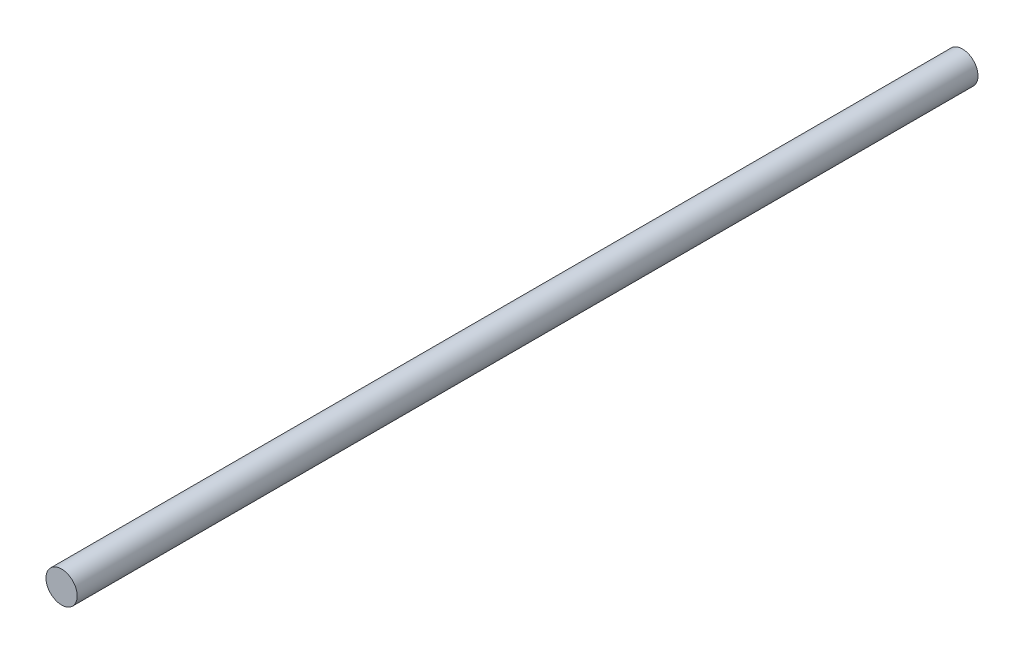
ISO-10303-21;
HEADER;
FILE_DESCRIPTION(('STEP AP214'),'2;1');
FILE_NAME('part.step','',(''),(''),'','','');
FILE_SCHEMA(('AUTOMOTIVE_DESIGN { 1 0 10303 214 1 1 1 1 }'));
ENDSEC;
DATA;
#1=APPLICATION_CONTEXT('core data for automotive mechanical design processes');
#2=APPLICATION_PROTOCOL_DEFINITION('international standard','automotive_design',2000,#1);
#3=PRODUCT_CONTEXT('',#1,'mechanical');
#4=PRODUCT('Part','Part','',(#3));
#5=PRODUCT_RELATED_PRODUCT_CATEGORY('part','',(#4));
#6=PRODUCT_DEFINITION_FORMATION('','',#4);
#7=PRODUCT_DEFINITION_CONTEXT('part definition',#1,'design');
#8=PRODUCT_DEFINITION('design','',#6,#7);
#9=PRODUCT_DEFINITION_SHAPE('','',#8);
#10=(LENGTH_UNIT() NAMED_UNIT(*) SI_UNIT(.MILLI.,.METRE.));
#11=(NAMED_UNIT(*) PLANE_ANGLE_UNIT() SI_UNIT($,.RADIAN.));
#12=(NAMED_UNIT(*) SI_UNIT($,.STERADIAN.) SOLID_ANGLE_UNIT());
#13=UNCERTAINTY_MEASURE_WITH_UNIT(LENGTH_MEASURE(1.E-05),#10,'distance_accuracy_value','');
#14=(GEOMETRIC_REPRESENTATION_CONTEXT(3) GLOBAL_UNCERTAINTY_ASSIGNED_CONTEXT((#13)) GLOBAL_UNIT_ASSIGNED_CONTEXT((#10,
#11,#12)) REPRESENTATION_CONTEXT('',''));
#15=CARTESIAN_POINT('',(0.,0.,0.));
#16=DIRECTION('',(0.,0.,1.));
#17=DIRECTION('',(1.,0.,0.));
#18=AXIS2_PLACEMENT_3D('',#15,#16,#17);
#19=CARTESIAN_POINT('',(0.,0.,288.5));
#20=DIRECTION('',(0.,0.,-1.));
#21=DIRECTION('',(-1.,0.,0.));
#22=AXIS2_PLACEMENT_3D('',#19,#20,#21);
#23=CYLINDRICAL_SURFACE('',#22,5.);
#24=CARTESIAN_POINT('',(0.,0.,288.5));
#25=DIRECTION('',(0.,0.,1.));
#26=DIRECTION('',(1.,0.,0.));
#27=AXIS2_PLACEMENT_3D('',#24,#25,#26);
#28=CIRCLE('',#27,5.);
#29=CARTESIAN_POINT('',(5.,0.,288.5));
#30=VERTEX_POINT('',#29);
#31=EDGE_CURVE('E10',#30,#30,#28,.T.);
#32=ORIENTED_EDGE('',*,*,#31,.F.);
#33=EDGE_LOOP('',(#32));
#34=FACE_BOUND('',#33,.T.);
#35=CARTESIAN_POINT('',(0.,0.,0.));
#36=DIRECTION('',(0.,0.,1.));
#37=DIRECTION('',(1.,0.,0.));
#38=AXIS2_PLACEMENT_3D('',#35,#36,#37);
#39=CIRCLE('',#38,5.);
#40=CARTESIAN_POINT('',(5.,0.,0.));
#41=VERTEX_POINT('',#40);
#42=EDGE_CURVE('E35',#41,#41,#39,.T.);
#43=ORIENTED_EDGE('',*,*,#42,.T.);
#44=EDGE_LOOP('',(#43));
#45=FACE_BOUND('',#44,.T.);
#46=ADVANCED_FACE('F32',(#34,#45),#23,.T.);
#47=CARTESIAN_POINT('',(0.,0.,288.5));
#48=DIRECTION('',(0.,0.,1.));
#49=DIRECTION('',(1.,0.,0.));
#50=AXIS2_PLACEMENT_3D('',#47,#48,#49);
#51=PLANE('',#50);
#52=ORIENTED_EDGE('',*,*,#31,.T.);
#53=EDGE_LOOP('',(#52));
#54=FACE_BOUND('',#53,.T.);
#55=ADVANCED_FACE('F47',(#54),#51,.T.);
#56=CARTESIAN_POINT('',(0.,0.,0.));
#57=DIRECTION('',(0.,0.,1.));
#58=DIRECTION('',(1.,0.,0.));
#59=AXIS2_PLACEMENT_3D('',#56,#57,#58);
#60=PLANE('',#59);
#61=ORIENTED_EDGE('',*,*,#42,.F.);
#62=EDGE_LOOP('',(#61));
#63=FACE_BOUND('',#62,.T.);
#64=ADVANCED_FACE('F45',(#63),#60,.F.);
#65=CLOSED_SHELL('',(#46,#55,#64));
#66=MANIFOLD_SOLID_BREP('B2',#65);
#67=ADVANCED_BREP_SHAPE_REPRESENTATION('',(#18,#66),#14);
#68=SHAPE_DEFINITION_REPRESENTATION(#9,#67);
ENDSEC;
END-ISO-10303-21;
